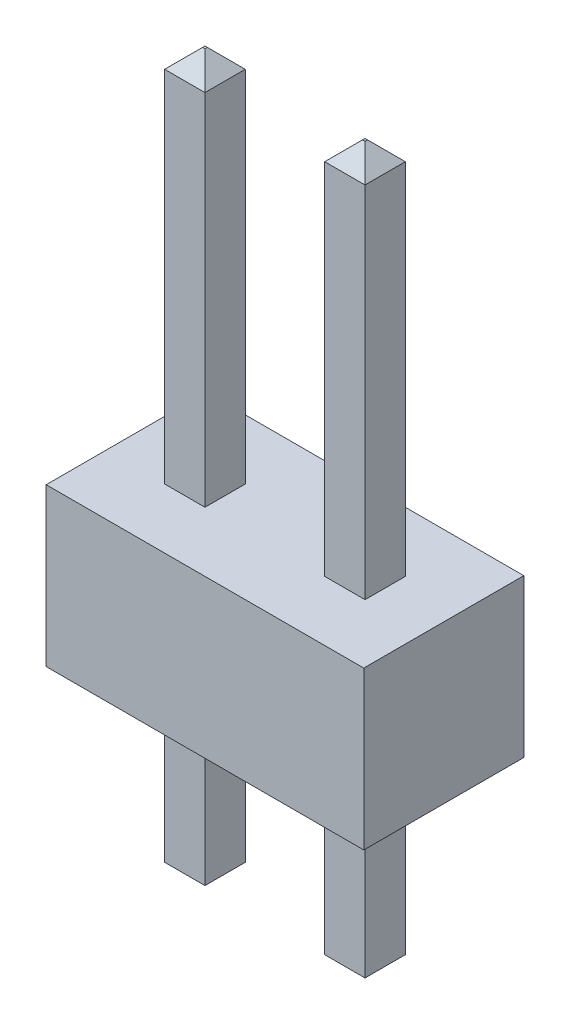
ISO-10303-21;
HEADER;
FILE_DESCRIPTION(('STEP AP214'),'2;1');
FILE_NAME('part.step','',(''),(''),'','','');
FILE_SCHEMA(('AUTOMOTIVE_DESIGN { 1 0 10303 214 1 1 1 1 }'));
ENDSEC;
DATA;
#1=APPLICATION_CONTEXT('core data for automotive mechanical design processes');
#2=APPLICATION_PROTOCOL_DEFINITION('international standard','automotive_design',2000,#1);
#3=PRODUCT_CONTEXT('',#1,'mechanical');
#4=PRODUCT('Part','Part','',(#3));
#5=PRODUCT_RELATED_PRODUCT_CATEGORY('part','',(#4));
#6=PRODUCT_DEFINITION_FORMATION('','',#4);
#7=PRODUCT_DEFINITION_CONTEXT('part definition',#1,'design');
#8=PRODUCT_DEFINITION('design','',#6,#7);
#9=PRODUCT_DEFINITION_SHAPE('','',#8);
#10=(LENGTH_UNIT() NAMED_UNIT(*) SI_UNIT(.MILLI.,.METRE.));
#11=(NAMED_UNIT(*) PLANE_ANGLE_UNIT() SI_UNIT($,.RADIAN.));
#12=(NAMED_UNIT(*) SI_UNIT($,.STERADIAN.) SOLID_ANGLE_UNIT());
#13=UNCERTAINTY_MEASURE_WITH_UNIT(LENGTH_MEASURE(1.E-05),#10,'distance_accuracy_value','');
#14=(GEOMETRIC_REPRESENTATION_CONTEXT(3) GLOBAL_UNCERTAINTY_ASSIGNED_CONTEXT((#13)) GLOBAL_UNIT_ASSIGNED_CONTEXT((#10,
#11,#12)) REPRESENTATION_CONTEXT('',''));
#15=CARTESIAN_POINT('',(0.,0.,0.));
#16=DIRECTION('',(0.,0.,1.));
#17=DIRECTION('',(1.,0.,0.));
#18=AXIS2_PLACEMENT_3D('',#15,#16,#17);
#19=CARTESIAN_POINT('',(1.23,-3.,1.59));
#20=DIRECTION('',(0.707106781186548,0.707106781186548,0.));
#21=DIRECTION('',(-0.707106781186548,0.707106781186548,0.));
#22=AXIS2_PLACEMENT_3D('',#19,#20,#21);
#23=PLANE('',#22);
#24=DIRECTION('',(0.,0.,-1.));
#25=VECTOR('',#24,1.);
#26=CARTESIAN_POINT('',(0.930000000000001,-2.7,0.950000000000001));
#27=LINE('',#26,#25);
#28=CARTESIAN_POINT('',(0.930000000000001,-2.7,1.59));
#29=VERTEX_POINT('',#28);
#30=CARTESIAN_POINT('',(0.930000000000001,-2.7,0.950000000000001));
#31=VERTEX_POINT('',#30);
#32=EDGE_CURVE('E448',#29,#31,#27,.T.);
#33=ORIENTED_EDGE('',*,*,#32,.T.);
#34=DIRECTION('',(0.577350269189625,-0.577350269189625,0.577350269189627));
#35=VECTOR('',#34,1.);
#36=CARTESIAN_POINT('',(0.930000000000001,-2.7,0.95));
#37=LINE('',#36,#35);
#38=CARTESIAN_POINT('',(1.23,-3.,1.25));
#39=VERTEX_POINT('',#38);
#40=EDGE_CURVE('E217',#31,#39,#37,.T.);
#41=ORIENTED_EDGE('',*,*,#40,.T.);
#42=DIRECTION('',(0.,0.,1.));
#43=VECTOR('',#42,1.);
#44=CARTESIAN_POINT('',(1.23,-3.,1.59));
#45=LINE('',#44,#43);
#46=CARTESIAN_POINT('',(1.23,-3.,1.29));
#47=VERTEX_POINT('',#46);
#48=EDGE_CURVE('E459',#39,#47,#45,.T.);
#49=ORIENTED_EDGE('',*,*,#48,.T.);
#50=DIRECTION('',(-0.577350269189625,0.577350269189626,0.577350269189626));
#51=VECTOR('',#50,1.);
#52=CARTESIAN_POINT('',(1.23,-3.,1.29));
#53=LINE('',#52,#51);
#54=EDGE_CURVE('E453',#47,#29,#53,.T.);
#55=ORIENTED_EDGE('',*,*,#54,.T.);
#56=EDGE_LOOP('',(#33,#41,#49,#55));
#57=FACE_BOUND('',#56,.T.);
#58=ADVANCED_FACE('F36',(#57),#23,.F.);
#59=CARTESIAN_POINT('',(3.77,-3.,1.59));
#60=DIRECTION('',(0.707106781186548,0.707106781186548,0.));
#61=DIRECTION('',(-0.707106781186548,0.707106781186548,0.));
#62=AXIS2_PLACEMENT_3D('',#59,#60,#61);
#63=PLANE('',#62);
#64=DIRECTION('',(0.,0.,-1.));
#65=VECTOR('',#64,1.);
#66=CARTESIAN_POINT('',(3.47,-2.7,0.950000000000001));
#67=LINE('',#66,#65);
#68=CARTESIAN_POINT('',(3.47,-2.7,1.59));
#69=VERTEX_POINT('',#68);
#70=CARTESIAN_POINT('',(3.47,-2.7,0.950000000000001));
#71=VERTEX_POINT('',#70);
#72=EDGE_CURVE('E427',#69,#71,#67,.T.);
#73=ORIENTED_EDGE('',*,*,#72,.T.);
#74=DIRECTION('',(0.577350269189626,-0.577350269189625,0.577350269189626));
#75=VECTOR('',#74,1.);
#76=CARTESIAN_POINT('',(3.47,-2.7,0.95));
#77=LINE('',#76,#75);
#78=CARTESIAN_POINT('',(3.77,-3.,1.25));
#79=VERTEX_POINT('',#78);
#80=EDGE_CURVE('E442',#71,#79,#77,.T.);
#81=ORIENTED_EDGE('',*,*,#80,.T.);
#82=DIRECTION('',(0.,0.,1.));
#83=VECTOR('',#82,1.);
#84=CARTESIAN_POINT('',(3.77,-3.,1.59));
#85=LINE('',#84,#83);
#86=CARTESIAN_POINT('',(3.77,-3.,1.29));
#87=VERTEX_POINT('',#86);
#88=EDGE_CURVE('E446',#79,#87,#85,.T.);
#89=ORIENTED_EDGE('',*,*,#88,.T.);
#90=DIRECTION('',(-0.577350269189626,0.577350269189626,0.577350269189626));
#91=VECTOR('',#90,1.);
#92=CARTESIAN_POINT('',(3.77,-3.,1.29));
#93=LINE('',#92,#91);
#94=EDGE_CURVE('E433',#87,#69,#93,.T.);
#95=ORIENTED_EDGE('',*,*,#94,.T.);
#96=EDGE_LOOP('',(#73,#81,#89,#95));
#97=FACE_BOUND('',#96,.T.);
#98=ADVANCED_FACE('F488',(#97),#63,.F.);
#99=CARTESIAN_POINT('',(1.57,-3.,1.25));
#100=DIRECTION('',(0.,0.707106781186548,0.707106781186547));
#101=DIRECTION('',(0.,-0.707106781186547,0.707106781186548));
#102=AXIS2_PLACEMENT_3D('',#99,#100,#101);
#103=PLANE('',#102);
#104=DIRECTION('',(1.,0.,0.));
#105=VECTOR('',#104,1.);
#106=CARTESIAN_POINT('',(0.930000000000001,-2.7,0.950000000000001));
#107=LINE('',#106,#105);
#108=CARTESIAN_POINT('',(1.57,-2.7,0.950000000000001));
#109=VERTEX_POINT('',#108);
#110=EDGE_CURVE('E415',#31,#109,#107,.T.);
#111=ORIENTED_EDGE('',*,*,#110,.T.);
#112=DIRECTION('',(-0.577350269189626,-0.577350269189626,0.577350269189625));
#113=VECTOR('',#112,1.);
#114=CARTESIAN_POINT('',(1.57,-2.7,0.950000000000001));
#115=LINE('',#114,#113);
#116=CARTESIAN_POINT('',(1.27,-3.,1.25));
#117=VERTEX_POINT('',#116);
#118=EDGE_CURVE('E412',#109,#117,#115,.T.);
#119=ORIENTED_EDGE('',*,*,#118,.T.);
#120=DIRECTION('',(1.,0.,0.));
#121=VECTOR('',#120,1.);
#122=CARTESIAN_POINT('',(1.57,-3.,1.25));
#123=LINE('',#122,#121);
#124=EDGE_CURVE('E461',#117,#39,#123,.F.);
#125=ORIENTED_EDGE('',*,*,#124,.T.);
#126=ORIENTED_EDGE('',*,*,#40,.F.);
#127=EDGE_LOOP('',(#111,#119,#125,#126));
#128=FACE_BOUND('',#127,.T.);
#129=ADVANCED_FACE('F464',(#128),#103,.F.);
#130=CARTESIAN_POINT('',(1.57,-3.,1.59));
#131=DIRECTION('',(0.,1.,0.));
#132=DIRECTION('',(0.,0.,1.));
#133=AXIS2_PLACEMENT_3D('',#130,#131,#132);
#134=PLANE('',#133);
#135=ORIENTED_EDGE('',*,*,#124,.F.);
#136=DIRECTION('',(0.,0.,1.));
#137=VECTOR('',#136,1.);
#138=CARTESIAN_POINT('',(1.27,-3.,1.59));
#139=LINE('',#138,#137);
#140=CARTESIAN_POINT('',(1.27,-3.,1.29));
#141=VERTEX_POINT('',#140);
#142=EDGE_CURVE('E409',#117,#141,#139,.T.);
#143=ORIENTED_EDGE('',*,*,#142,.T.);
#144=DIRECTION('',(1.,0.,0.));
#145=VECTOR('',#144,1.);
#146=CARTESIAN_POINT('',(1.57,-3.,1.29));
#147=LINE('',#146,#145);
#148=EDGE_CURVE('E456',#141,#47,#147,.F.);
#149=ORIENTED_EDGE('',*,*,#148,.T.);
#150=ORIENTED_EDGE('',*,*,#48,.F.);
#151=EDGE_LOOP('',(#135,#143,#149,#150));
#152=FACE_BOUND('',#151,.T.);
#153=ADVANCED_FACE('F467',(#152),#134,.F.);
#154=CARTESIAN_POINT('',(1.57,-3.,1.29));
#155=DIRECTION('',(0.,0.707106781186548,-0.707106781186548));
#156=DIRECTION('',(0.,0.707106781186548,0.707106781186548));
#157=AXIS2_PLACEMENT_3D('',#154,#155,#156);
#158=PLANE('',#157);
#159=DIRECTION('',(-1.,0.,0.));
#160=VECTOR('',#159,1.);
#161=CARTESIAN_POINT('',(0.930000000000001,-2.7,1.59));
#162=LINE('',#161,#160);
#163=CARTESIAN_POINT('',(1.57,-2.7,1.59));
#164=VERTEX_POINT('',#163);
#165=EDGE_CURVE('E401',#164,#29,#162,.T.);
#166=ORIENTED_EDGE('',*,*,#165,.T.);
#167=ORIENTED_EDGE('',*,*,#54,.F.);
#168=ORIENTED_EDGE('',*,*,#148,.F.);
#169=DIRECTION('',(0.577350269189626,0.577350269189626,0.577350269189626));
#170=VECTOR('',#169,1.);
#171=CARTESIAN_POINT('',(1.27,-3.,1.29));
#172=LINE('',#171,#170);
#173=EDGE_CURVE('E406',#141,#164,#172,.T.);
#174=ORIENTED_EDGE('',*,*,#173,.T.);
#175=EDGE_LOOP('',(#166,#167,#168,#174));
#176=FACE_BOUND('',#175,.T.);
#177=ADVANCED_FACE('F474',(#176),#158,.F.);
#178=CARTESIAN_POINT('',(0.930000000000001,-3.,0.950000000000001));
#179=DIRECTION('',(1.,0.,0.));
#180=DIRECTION('',(0.,0.,-1.));
#181=AXIS2_PLACEMENT_3D('',#178,#179,#180);
#182=PLANE('',#181);
#183=ORIENTED_EDGE('',*,*,#32,.F.);
#184=DIRECTION('',(0.,1.,0.));
#185=VECTOR('',#184,1.);
#186=CARTESIAN_POINT('',(0.930000000000001,-3.,1.59));
#187=LINE('',#186,#185);
#188=CARTESIAN_POINT('',(0.930000000000001,0.,1.59));
#189=VERTEX_POINT('',#188);
#190=EDGE_CURVE('E398',#29,#189,#187,.T.);
#191=ORIENTED_EDGE('',*,*,#190,.T.);
#192=DIRECTION('',(0.,0.,-1.));
#193=VECTOR('',#192,1.);
#194=CARTESIAN_POINT('',(0.930000000000001,0.,0.950000000000001));
#195=LINE('',#194,#193);
#196=CARTESIAN_POINT('',(0.930000000000001,0.,0.950000000000001));
#197=VERTEX_POINT('',#196);
#198=EDGE_CURVE('E450',#197,#189,#195,.F.);
#199=ORIENTED_EDGE('',*,*,#198,.F.);
#200=DIRECTION('',(0.,1.,0.));
#201=VECTOR('',#200,1.);
#202=CARTESIAN_POINT('',(0.930000000000001,-3.,0.950000000000001));
#203=LINE('',#202,#201);
#204=EDGE_CURVE('E419',#197,#31,#203,.F.);
#205=ORIENTED_EDGE('',*,*,#204,.T.);
#206=EDGE_LOOP('',(#183,#191,#199,#205));
#207=FACE_BOUND('',#206,.T.);
#208=ADVANCED_FACE('F484',(#207),#182,.F.);
#209=CARTESIAN_POINT('',(4.11,-3.,1.59));
#210=DIRECTION('',(0.,1.,0.));
#211=DIRECTION('',(0.,0.,1.));
#212=AXIS2_PLACEMENT_3D('',#209,#210,#211);
#213=PLANE('',#212);
#214=ORIENTED_EDGE('',*,*,#88,.F.);
#215=DIRECTION('',(1.,0.,0.));
#216=VECTOR('',#215,1.);
#217=CARTESIAN_POINT('',(4.11,-3.,1.25));
#218=LINE('',#217,#216);
#219=CARTESIAN_POINT('',(3.81,-3.,1.25));
#220=VERTEX_POINT('',#219);
#221=EDGE_CURVE('E439',#79,#220,#218,.T.);
#222=ORIENTED_EDGE('',*,*,#221,.T.);
#223=DIRECTION('',(0.,0.,1.));
#224=VECTOR('',#223,1.);
#225=CARTESIAN_POINT('',(3.81,-3.,1.59));
#226=LINE('',#225,#224);
#227=CARTESIAN_POINT('',(3.81,-3.,1.29));
#228=VERTEX_POINT('',#227);
#229=EDGE_CURVE('E384',#220,#228,#226,.T.);
#230=ORIENTED_EDGE('',*,*,#229,.T.);
#231=DIRECTION('',(1.,0.,0.));
#232=VECTOR('',#231,1.);
#233=CARTESIAN_POINT('',(4.11,-3.,1.29));
#234=LINE('',#233,#232);
#235=EDGE_CURVE('E436',#228,#87,#234,.F.);
#236=ORIENTED_EDGE('',*,*,#235,.T.);
#237=EDGE_LOOP('',(#214,#222,#230,#236));
#238=FACE_BOUND('',#237,.T.);
#239=ADVANCED_FACE('F624',(#238),#213,.F.);
#240=CARTESIAN_POINT('',(4.11,-3.,1.25));
#241=DIRECTION('',(0.,0.707106781186548,0.707106781186547));
#242=DIRECTION('',(0.,-0.707106781186547,0.707106781186548));
#243=AXIS2_PLACEMENT_3D('',#240,#241,#242);
#244=PLANE('',#243);
#245=ORIENTED_EDGE('',*,*,#221,.F.);
#246=ORIENTED_EDGE('',*,*,#80,.F.);
#247=DIRECTION('',(1.,0.,0.));
#248=VECTOR('',#247,1.);
#249=CARTESIAN_POINT('',(3.47,-2.7,0.950000000000001));
#250=LINE('',#249,#248);
#251=CARTESIAN_POINT('',(4.11,-2.7,0.950000000000001));
#252=VERTEX_POINT('',#251);
#253=EDGE_CURVE('E387',#71,#252,#250,.T.);
#254=ORIENTED_EDGE('',*,*,#253,.T.);
#255=DIRECTION('',(-0.577350269189627,-0.577350269189627,0.577350269189624));
#256=VECTOR('',#255,1.);
#257=CARTESIAN_POINT('',(4.11,-2.7,0.950000000000001));
#258=LINE('',#257,#256);
#259=EDGE_CURVE('E378',#252,#220,#258,.T.);
#260=ORIENTED_EDGE('',*,*,#259,.T.);
#261=EDGE_LOOP('',(#245,#246,#254,#260));
#262=FACE_BOUND('',#261,.T.);
#263=ADVANCED_FACE('F620',(#262),#244,.F.);
#264=CARTESIAN_POINT('',(4.11,-3.,1.29));
#265=DIRECTION('',(0.,0.707106781186548,-0.707106781186548));
#266=DIRECTION('',(0.,0.707106781186548,0.707106781186548));
#267=AXIS2_PLACEMENT_3D('',#264,#265,#266);
#268=PLANE('',#267);
#269=DIRECTION('',(-1.,0.,0.));
#270=VECTOR('',#269,1.);
#271=CARTESIAN_POINT('',(3.47,-2.7,1.59));
#272=LINE('',#271,#270);
#273=CARTESIAN_POINT('',(4.11,-2.7,1.59));
#274=VERTEX_POINT('',#273);
#275=EDGE_CURVE('E372',#274,#69,#272,.T.);
#276=ORIENTED_EDGE('',*,*,#275,.T.);
#277=ORIENTED_EDGE('',*,*,#94,.F.);
#278=ORIENTED_EDGE('',*,*,#235,.F.);
#279=DIRECTION('',(0.577350269189626,0.577350269189626,0.577350269189625));
#280=VECTOR('',#279,1.);
#281=CARTESIAN_POINT('',(3.81,-3.,1.29));
#282=LINE('',#281,#280);
#283=EDGE_CURVE('E381',#228,#274,#282,.T.);
#284=ORIENTED_EDGE('',*,*,#283,.T.);
#285=EDGE_LOOP('',(#276,#277,#278,#284));
#286=FACE_BOUND('',#285,.T.);
#287=ADVANCED_FACE('F616',(#286),#268,.F.);
#288=CARTESIAN_POINT('',(3.47,-3.,0.950000000000001));
#289=DIRECTION('',(1.,0.,0.));
#290=DIRECTION('',(0.,0.,-1.));
#291=AXIS2_PLACEMENT_3D('',#288,#289,#290);
#292=PLANE('',#291);
#293=ORIENTED_EDGE('',*,*,#72,.F.);
#294=DIRECTION('',(0.,1.,0.));
#295=VECTOR('',#294,1.);
#296=CARTESIAN_POINT('',(3.47,-3.,1.59));
#297=LINE('',#296,#295);
#298=CARTESIAN_POINT('',(3.47,0.,1.59));
#299=VERTEX_POINT('',#298);
#300=EDGE_CURVE('E368',#69,#299,#297,.T.);
#301=ORIENTED_EDGE('',*,*,#300,.T.);
#302=DIRECTION('',(0.,0.,-1.));
#303=VECTOR('',#302,1.);
#304=CARTESIAN_POINT('',(3.47,0.,0.950000000000001));
#305=LINE('',#304,#303);
#306=CARTESIAN_POINT('',(3.47,0.,0.950000000000001));
#307=VERTEX_POINT('',#306);
#308=EDGE_CURVE('E430',#307,#299,#305,.F.);
#309=ORIENTED_EDGE('',*,*,#308,.F.);
#310=DIRECTION('',(0.,1.,0.));
#311=VECTOR('',#310,1.);
#312=CARTESIAN_POINT('',(3.47,-3.,0.950000000000001));
#313=LINE('',#312,#311);
#314=EDGE_CURVE('E391',#307,#71,#313,.F.);
#315=ORIENTED_EDGE('',*,*,#314,.T.);
#316=EDGE_LOOP('',(#293,#301,#309,#315));
#317=FACE_BOUND('',#316,.T.);
#318=ADVANCED_FACE('F612',(#317),#292,.F.);
#319=CARTESIAN_POINT('',(0.930000000000001,-3.,0.950000000000001));
#320=DIRECTION('',(0.,0.,1.));
#321=DIRECTION('',(1.,0.,0.));
#322=AXIS2_PLACEMENT_3D('',#319,#320,#321);
#323=PLANE('',#322);
#324=ORIENTED_EDGE('',*,*,#110,.F.);
#325=ORIENTED_EDGE('',*,*,#204,.F.);
#326=DIRECTION('',(1.,0.,0.));
#327=VECTOR('',#326,1.);
#328=CARTESIAN_POINT('',(0.930000000000001,0.,0.950000000000001));
#329=LINE('',#328,#327);
#330=CARTESIAN_POINT('',(1.57,0.,0.950000000000001));
#331=VERTEX_POINT('',#330);
#332=EDGE_CURVE('E423',#331,#197,#329,.F.);
#333=ORIENTED_EDGE('',*,*,#332,.F.);
#334=DIRECTION('',(0.,1.,0.));
#335=VECTOR('',#334,1.);
#336=CARTESIAN_POINT('',(1.57,-3.,0.950000000000001));
#337=LINE('',#336,#335);
#338=EDGE_CURVE('E364',#331,#109,#337,.F.);
#339=ORIENTED_EDGE('',*,*,#338,.T.);
#340=EDGE_LOOP('',(#324,#325,#333,#339));
#341=FACE_BOUND('',#340,.T.);
#342=ADVANCED_FACE('F609',(#341),#323,.F.);
#343=CARTESIAN_POINT('',(1.27,-3.,1.59));
#344=DIRECTION('',(-0.707106781186548,0.707106781186548,0.));
#345=DIRECTION('',(-0.707106781186548,-0.707106781186548,0.));
#346=AXIS2_PLACEMENT_3D('',#343,#344,#345);
#347=PLANE('',#346);
#348=ORIENTED_EDGE('',*,*,#142,.F.);
#349=ORIENTED_EDGE('',*,*,#118,.F.);
#350=DIRECTION('',(0.,0.,1.));
#351=VECTOR('',#350,1.);
#352=CARTESIAN_POINT('',(1.57,-2.7,0.950000000000001));
#353=LINE('',#352,#351);
#354=EDGE_CURVE('E361',#109,#164,#353,.T.);
#355=ORIENTED_EDGE('',*,*,#354,.T.);
#356=ORIENTED_EDGE('',*,*,#173,.F.);
#357=EDGE_LOOP('',(#348,#349,#355,#356));
#358=FACE_BOUND('',#357,.T.);
#359=ADVANCED_FACE('F470',(#358),#347,.F.);
#360=CARTESIAN_POINT('',(0.930000000000001,-3.,1.59));
#361=DIRECTION('',(0.,0.,-1.));
#362=DIRECTION('',(-1.,0.,0.));
#363=AXIS2_PLACEMENT_3D('',#360,#361,#362);
#364=PLANE('',#363);
#365=ORIENTED_EDGE('',*,*,#165,.F.);
#366=DIRECTION('',(0.,1.,0.));
#367=VECTOR('',#366,1.);
#368=CARTESIAN_POINT('',(1.57,-3.,1.59));
#369=LINE('',#368,#367);
#370=CARTESIAN_POINT('',(1.57,0.,1.59));
#371=VERTEX_POINT('',#370);
#372=EDGE_CURVE('E358',#164,#371,#369,.T.);
#373=ORIENTED_EDGE('',*,*,#372,.T.);
#374=DIRECTION('',(-1.,0.,0.));
#375=VECTOR('',#374,1.);
#376=CARTESIAN_POINT('',(0.930000000000001,0.,1.59));
#377=LINE('',#376,#375);
#378=EDGE_CURVE('E404',#189,#371,#377,.F.);
#379=ORIENTED_EDGE('',*,*,#378,.F.);
#380=ORIENTED_EDGE('',*,*,#190,.F.);
#381=EDGE_LOOP('',(#365,#373,#379,#380));
#382=FACE_BOUND('',#381,.T.);
#383=ADVANCED_FACE('F481',(#382),#364,.F.);
#384=CARTESIAN_POINT('',(3.47,-3.,0.950000000000001));
#385=DIRECTION('',(0.,0.,1.));
#386=DIRECTION('',(1.,0.,0.));
#387=AXIS2_PLACEMENT_3D('',#384,#385,#386);
#388=PLANE('',#387);
#389=ORIENTED_EDGE('',*,*,#253,.F.);
#390=ORIENTED_EDGE('',*,*,#314,.F.);
#391=DIRECTION('',(1.,0.,0.));
#392=VECTOR('',#391,1.);
#393=CARTESIAN_POINT('',(3.47,0.,0.950000000000001));
#394=LINE('',#393,#392);
#395=CARTESIAN_POINT('',(4.11,0.,0.950000000000001));
#396=VERTEX_POINT('',#395);
#397=EDGE_CURVE('E395',#396,#307,#394,.F.);
#398=ORIENTED_EDGE('',*,*,#397,.F.);
#399=DIRECTION('',(0.,1.,0.));
#400=VECTOR('',#399,1.);
#401=CARTESIAN_POINT('',(4.11,-3.,0.950000000000001));
#402=LINE('',#401,#400);
#403=EDGE_CURVE('E354',#396,#252,#402,.F.);
#404=ORIENTED_EDGE('',*,*,#403,.T.);
#405=EDGE_LOOP('',(#389,#390,#398,#404));
#406=FACE_BOUND('',#405,.T.);
#407=ADVANCED_FACE('F600',(#406),#388,.F.);
#408=CARTESIAN_POINT('',(3.81,-3.,1.59));
#409=DIRECTION('',(-0.707106781186548,0.707106781186548,0.));
#410=DIRECTION('',(-0.707106781186548,-0.707106781186548,0.));
#411=AXIS2_PLACEMENT_3D('',#408,#409,#410);
#412=PLANE('',#411);
#413=DIRECTION('',(0.,0.,1.));
#414=VECTOR('',#413,1.);
#415=CARTESIAN_POINT('',(4.11,-2.7,0.950000000000001));
#416=LINE('',#415,#414);
#417=EDGE_CURVE('E350',#252,#274,#416,.T.);
#418=ORIENTED_EDGE('',*,*,#417,.T.);
#419=ORIENTED_EDGE('',*,*,#283,.F.);
#420=ORIENTED_EDGE('',*,*,#229,.F.);
#421=ORIENTED_EDGE('',*,*,#259,.F.);
#422=EDGE_LOOP('',(#418,#419,#420,#421));
#423=FACE_BOUND('',#422,.T.);
#424=ADVANCED_FACE('F596',(#423),#412,.F.);
#425=CARTESIAN_POINT('',(3.47,-3.,1.59));
#426=DIRECTION('',(0.,0.,-1.));
#427=DIRECTION('',(-1.,0.,0.));
#428=AXIS2_PLACEMENT_3D('',#425,#426,#427);
#429=PLANE('',#428);
#430=ORIENTED_EDGE('',*,*,#275,.F.);
#431=DIRECTION('',(0.,1.,0.));
#432=VECTOR('',#431,1.);
#433=CARTESIAN_POINT('',(4.11,-3.,1.59));
#434=LINE('',#433,#432);
#435=CARTESIAN_POINT('',(4.11,0.,1.59));
#436=VERTEX_POINT('',#435);
#437=EDGE_CURVE('E346',#274,#436,#434,.T.);
#438=ORIENTED_EDGE('',*,*,#437,.T.);
#439=DIRECTION('',(-1.,0.,0.));
#440=VECTOR('',#439,1.);
#441=CARTESIAN_POINT('',(3.47,0.,1.59));
#442=LINE('',#441,#440);
#443=EDGE_CURVE('E376',#299,#436,#442,.F.);
#444=ORIENTED_EDGE('',*,*,#443,.F.);
#445=ORIENTED_EDGE('',*,*,#300,.F.);
#446=EDGE_LOOP('',(#430,#438,#444,#445));
#447=FACE_BOUND('',#446,.T.);
#448=ADVANCED_FACE('F592',(#447),#429,.F.);
#449=CARTESIAN_POINT('',(1.23,8.5,1.59));
#450=DIRECTION('',(-0.707106781186549,0.707106781186546,0.));
#451=DIRECTION('',(-0.707106781186546,-0.707106781186549,0.));
#452=AXIS2_PLACEMENT_3D('',#449,#450,#451);
#453=PLANE('',#452);
#454=DIRECTION('',(-0.577350269189627,-0.577350269189627,0.577350269189624));
#455=VECTOR('',#454,1.);
#456=CARTESIAN_POINT('',(1.23,8.5,1.29));
#457=LINE('',#456,#455);
#458=CARTESIAN_POINT('',(1.23,8.5,1.29));
#459=VERTEX_POINT('',#458);
#460=CARTESIAN_POINT('',(0.929999999999999,8.2,1.59));
#461=VERTEX_POINT('',#460);
#462=EDGE_CURVE('E344',#459,#461,#457,.T.);
#463=ORIENTED_EDGE('',*,*,#462,.F.);
#464=DIRECTION('',(0.,0.,1.));
#465=VECTOR('',#464,1.);
#466=CARTESIAN_POINT('',(1.23,8.5,1.59));
#467=LINE('',#466,#465);
#468=CARTESIAN_POINT('',(1.23,8.5,1.25));
#469=VERTEX_POINT('',#468);
#470=EDGE_CURVE('E339',#469,#459,#467,.T.);
#471=ORIENTED_EDGE('',*,*,#470,.F.);
#472=DIRECTION('',(0.577350269189627,0.577350269189627,0.577350269189624));
#473=VECTOR('',#472,1.);
#474=CARTESIAN_POINT('',(0.929999999999998,8.2,0.95));
#475=LINE('',#474,#473);
#476=CARTESIAN_POINT('',(0.929999999999999,8.2,0.95));
#477=VERTEX_POINT('',#476);
#478=EDGE_CURVE('E337',#477,#469,#475,.T.);
#479=ORIENTED_EDGE('',*,*,#478,.F.);
#480=DIRECTION('',(0.,0.,-1.));
#481=VECTOR('',#480,1.);
#482=CARTESIAN_POINT('',(0.929999999999998,8.2,0.95));
#483=LINE('',#482,#481);
#484=EDGE_CURVE('E328',#477,#461,#483,.F.);
#485=ORIENTED_EDGE('',*,*,#484,.T.);
#486=EDGE_LOOP('',(#463,#471,#479,#485));
#487=FACE_BOUND('',#486,.T.);
#488=ADVANCED_FACE('F588',(#487),#453,.T.);
#489=CARTESIAN_POINT('',(3.77,8.5,1.59));
#490=DIRECTION('',(-0.70710678118655,0.707106781186545,0.));
#491=DIRECTION('',(-0.707106781186545,-0.70710678118655,0.));
#492=AXIS2_PLACEMENT_3D('',#489,#490,#491);
#493=PLANE('',#492);
#494=DIRECTION('',(-0.577350269189624,-0.577350269189628,0.577350269189625));
#495=VECTOR('',#494,1.);
#496=CARTESIAN_POINT('',(3.77,8.5,1.29));
#497=LINE('',#496,#495);
#498=CARTESIAN_POINT('',(3.77,8.5,1.29));
#499=VERTEX_POINT('',#498);
#500=CARTESIAN_POINT('',(3.47,8.2,1.59));
#501=VERTEX_POINT('',#500);
#502=EDGE_CURVE('E324',#499,#501,#497,.T.);
#503=ORIENTED_EDGE('',*,*,#502,.F.);
#504=DIRECTION('',(0.,0.,1.));
#505=VECTOR('',#504,1.);
#506=CARTESIAN_POINT('',(3.77,8.5,1.59));
#507=LINE('',#506,#505);
#508=CARTESIAN_POINT('',(3.77,8.5,1.25));
#509=VERTEX_POINT('',#508);
#510=EDGE_CURVE('E326',#509,#499,#507,.T.);
#511=ORIENTED_EDGE('',*,*,#510,.F.);
#512=DIRECTION('',(0.577350269189624,0.577350269189629,0.577350269189624));
#513=VECTOR('',#512,1.);
#514=CARTESIAN_POINT('',(3.47,8.2,0.950000000000001));
#515=LINE('',#514,#513);
#516=CARTESIAN_POINT('',(3.47,8.2,0.95));
#517=VERTEX_POINT('',#516);
#518=EDGE_CURVE('E319',#517,#509,#515,.T.);
#519=ORIENTED_EDGE('',*,*,#518,.F.);
#520=DIRECTION('',(0.,0.,-1.));
#521=VECTOR('',#520,1.);
#522=CARTESIAN_POINT('',(3.47,8.2,0.95));
#523=LINE('',#522,#521);
#524=EDGE_CURVE('E311',#517,#501,#523,.F.);
#525=ORIENTED_EDGE('',*,*,#524,.T.);
#526=EDGE_LOOP('',(#503,#511,#519,#525));
#527=FACE_BOUND('',#526,.T.);
#528=ADVANCED_FACE('F585',(#527),#493,.T.);
#529=CARTESIAN_POINT('',(1.57,-3.,0.950000000000001));
#530=DIRECTION('',(-1.,0.,0.));
#531=DIRECTION('',(0.,0.,1.));
#532=AXIS2_PLACEMENT_3D('',#529,#530,#531);
#533=PLANE('',#532);
#534=ORIENTED_EDGE('',*,*,#354,.F.);
#535=ORIENTED_EDGE('',*,*,#338,.F.);
#536=DIRECTION('',(0.,0.,1.));
#537=VECTOR('',#536,1.);
#538=CARTESIAN_POINT('',(1.57,0.,7.62));
#539=LINE('',#538,#537);
#540=EDGE_CURVE('E307',#331,#371,#539,.T.);
#541=ORIENTED_EDGE('',*,*,#540,.T.);
#542=ORIENTED_EDGE('',*,*,#372,.F.);
#543=EDGE_LOOP('',(#534,#535,#541,#542));
#544=FACE_BOUND('',#543,.T.);
#545=ADVANCED_FACE('F477',(#544),#533,.F.);
#546=CARTESIAN_POINT('',(4.11,-3.,0.950000000000001));
#547=DIRECTION('',(-1.,0.,0.));
#548=DIRECTION('',(0.,0.,1.));
#549=AXIS2_PLACEMENT_3D('',#546,#547,#548);
#550=PLANE('',#549);
#551=ORIENTED_EDGE('',*,*,#417,.F.);
#552=ORIENTED_EDGE('',*,*,#403,.F.);
#553=DIRECTION('',(0.,0.,1.));
#554=VECTOR('',#553,1.);
#555=CARTESIAN_POINT('',(4.11,0.,7.62));
#556=LINE('',#555,#554);
#557=EDGE_CURVE('E304',#396,#436,#556,.T.);
#558=ORIENTED_EDGE('',*,*,#557,.T.);
#559=ORIENTED_EDGE('',*,*,#437,.F.);
#560=EDGE_LOOP('',(#551,#552,#558,#559));
#561=FACE_BOUND('',#560,.T.);
#562=ADVANCED_FACE('F578',(#561),#550,.F.);
#563=CARTESIAN_POINT('',(1.57,8.5,1.29));
#564=DIRECTION('',(0.,0.707106781186545,0.70710678118655));
#565=DIRECTION('',(0.,-0.70710678118655,0.707106781186545));
#566=AXIS2_PLACEMENT_3D('',#563,#564,#565);
#567=PLANE('',#566);
#568=DIRECTION('',(0.577350269189625,-0.577350269189628,0.577350269189625));
#569=VECTOR('',#568,1.);
#570=CARTESIAN_POINT('',(1.27,8.5,1.29));
#571=LINE('',#570,#569);
#572=CARTESIAN_POINT('',(1.27,8.5,1.29));
#573=VERTEX_POINT('',#572);
#574=CARTESIAN_POINT('',(1.57,8.2,1.59));
#575=VERTEX_POINT('',#574);
#576=EDGE_CURVE('E291',#573,#575,#571,.T.);
#577=ORIENTED_EDGE('',*,*,#576,.F.);
#578=DIRECTION('',(1.,0.,0.));
#579=VECTOR('',#578,1.);
#580=CARTESIAN_POINT('',(1.57,8.5,1.29));
#581=LINE('',#580,#579);
#582=EDGE_CURVE('E342',#459,#573,#581,.T.);
#583=ORIENTED_EDGE('',*,*,#582,.F.);
#584=ORIENTED_EDGE('',*,*,#462,.T.);
#585=DIRECTION('',(-1.,0.,0.));
#586=VECTOR('',#585,1.);
#587=CARTESIAN_POINT('',(0.929999999999998,8.2,1.59));
#588=LINE('',#587,#586);
#589=EDGE_CURVE('E293',#461,#575,#588,.F.);
#590=ORIENTED_EDGE('',*,*,#589,.T.);
#591=EDGE_LOOP('',(#577,#583,#584,#590));
#592=FACE_BOUND('',#591,.T.);
#593=ADVANCED_FACE('F574',(#592),#567,.T.);
#594=CARTESIAN_POINT('',(1.57,8.5,1.59));
#595=DIRECTION('',(0.,1.,0.));
#596=DIRECTION('',(0.,0.,1.));
#597=AXIS2_PLACEMENT_3D('',#594,#595,#596);
#598=PLANE('',#597);
#599=DIRECTION('',(1.,0.,0.));
#600=VECTOR('',#599,1.);
#601=CARTESIAN_POINT('',(1.57,8.5,1.25));
#602=LINE('',#601,#600);
#603=CARTESIAN_POINT('',(1.27,8.5,1.25));
#604=VERTEX_POINT('',#603);
#605=EDGE_CURVE('E335',#469,#604,#602,.T.);
#606=ORIENTED_EDGE('',*,*,#605,.F.);
#607=ORIENTED_EDGE('',*,*,#470,.T.);
#608=ORIENTED_EDGE('',*,*,#582,.T.);
#609=DIRECTION('',(0.,0.,1.));
#610=VECTOR('',#609,1.);
#611=CARTESIAN_POINT('',(1.27,8.5,1.59));
#612=LINE('',#611,#610);
#613=EDGE_CURVE('E285',#604,#573,#612,.T.);
#614=ORIENTED_EDGE('',*,*,#613,.F.);
#615=EDGE_LOOP('',(#606,#607,#608,#614));
#616=FACE_BOUND('',#615,.T.);
#617=ADVANCED_FACE('F570',(#616),#598,.T.);
#618=CARTESIAN_POINT('',(1.57,8.5,1.25));
#619=DIRECTION('',(0.,0.707106781186546,-0.707106781186549));
#620=DIRECTION('',(0.,0.707106781186549,0.707106781186546));
#621=AXIS2_PLACEMENT_3D('',#618,#619,#620);
#622=PLANE('',#621);
#623=DIRECTION('',(-0.577350269189625,0.577350269189628,0.577350269189625));
#624=VECTOR('',#623,1.);
#625=CARTESIAN_POINT('',(1.57,8.2,0.95));
#626=LINE('',#625,#624);
#627=CARTESIAN_POINT('',(1.57,8.2,0.95));
#628=VERTEX_POINT('',#627);
#629=EDGE_CURVE('E288',#628,#604,#626,.T.);
#630=ORIENTED_EDGE('',*,*,#629,.F.);
#631=DIRECTION('',(1.,0.,0.));
#632=VECTOR('',#631,1.);
#633=CARTESIAN_POINT('',(0.929999999999998,8.2,0.95));
#634=LINE('',#633,#632);
#635=EDGE_CURVE('E280',#628,#477,#634,.F.);
#636=ORIENTED_EDGE('',*,*,#635,.T.);
#637=ORIENTED_EDGE('',*,*,#478,.T.);
#638=ORIENTED_EDGE('',*,*,#605,.T.);
#639=EDGE_LOOP('',(#630,#636,#637,#638));
#640=FACE_BOUND('',#639,.T.);
#641=ADVANCED_FACE('F566',(#640),#622,.T.);
#642=CARTESIAN_POINT('',(0.929999999999998,8.5,0.95));
#643=DIRECTION('',(1.,0.,0.));
#644=DIRECTION('',(0.,0.,-1.));
#645=AXIS2_PLACEMENT_3D('',#642,#643,#644);
#646=PLANE('',#645);
#647=ORIENTED_EDGE('',*,*,#484,.F.);
#648=DIRECTION('',(0.,1.,0.));
#649=VECTOR('',#648,1.);
#650=CARTESIAN_POINT('',(0.929999999999998,8.5,0.95));
#651=LINE('',#650,#649);
#652=CARTESIAN_POINT('',(0.929999999999998,2.5,0.95));
#653=VERTEX_POINT('',#652);
#654=EDGE_CURVE('E277',#477,#653,#651,.F.);
#655=ORIENTED_EDGE('',*,*,#654,.T.);
#656=DIRECTION('',(0.,0.,-1.));
#657=VECTOR('',#656,1.);
#658=CARTESIAN_POINT('',(0.929999999999998,2.5,0.95));
#659=LINE('',#658,#657);
#660=CARTESIAN_POINT('',(0.929999999999998,2.5,1.59));
#661=VERTEX_POINT('',#660);
#662=EDGE_CURVE('E331',#661,#653,#659,.T.);
#663=ORIENTED_EDGE('',*,*,#662,.F.);
#664=DIRECTION('',(0.,1.,0.));
#665=VECTOR('',#664,1.);
#666=CARTESIAN_POINT('',(0.929999999999998,8.5,1.59));
#667=LINE('',#666,#665);
#668=EDGE_CURVE('E296',#661,#461,#667,.T.);
#669=ORIENTED_EDGE('',*,*,#668,.T.);
#670=EDGE_LOOP('',(#647,#655,#663,#669));
#671=FACE_BOUND('',#670,.T.);
#672=ADVANCED_FACE('F562',(#671),#646,.F.);
#673=CARTESIAN_POINT('',(4.11,8.5,1.59));
#674=DIRECTION('',(0.,1.,0.));
#675=DIRECTION('',(0.,0.,1.));
#676=AXIS2_PLACEMENT_3D('',#673,#674,#675);
#677=PLANE('',#676);
#678=DIRECTION('',(0.,0.,1.));
#679=VECTOR('',#678,1.);
#680=CARTESIAN_POINT('',(3.81,8.5,1.59));
#681=LINE('',#680,#679);
#682=CARTESIAN_POINT('',(3.81,8.5,1.25));
#683=VERTEX_POINT('',#682);
#684=CARTESIAN_POINT('',(3.81,8.5,1.29));
#685=VERTEX_POINT('',#684);
#686=EDGE_CURVE('E264',#683,#685,#681,.T.);
#687=ORIENTED_EDGE('',*,*,#686,.F.);
#688=DIRECTION('',(1.,0.,0.));
#689=VECTOR('',#688,1.);
#690=CARTESIAN_POINT('',(4.11,8.5,1.25));
#691=LINE('',#690,#689);
#692=EDGE_CURVE('E317',#509,#683,#691,.T.);
#693=ORIENTED_EDGE('',*,*,#692,.F.);
#694=ORIENTED_EDGE('',*,*,#510,.T.);
#695=DIRECTION('',(1.,0.,0.));
#696=VECTOR('',#695,1.);
#697=CARTESIAN_POINT('',(4.11,8.5,1.29));
#698=LINE('',#697,#696);
#699=EDGE_CURVE('E321',#685,#499,#698,.F.);
#700=ORIENTED_EDGE('',*,*,#699,.F.);
#701=EDGE_LOOP('',(#687,#693,#694,#700));
#702=FACE_BOUND('',#701,.T.);
#703=ADVANCED_FACE('F558',(#702),#677,.T.);
#704=CARTESIAN_POINT('',(4.11,8.5,1.29));
#705=DIRECTION('',(0.,0.707106781186545,0.70710678118655));
#706=DIRECTION('',(0.,-0.70710678118655,0.707106781186545));
#707=AXIS2_PLACEMENT_3D('',#704,#705,#706);
#708=PLANE('',#707);
#709=DIRECTION('',(0.577350269189625,-0.577350269189628,0.577350269189625));
#710=VECTOR('',#709,1.);
#711=CARTESIAN_POINT('',(3.81,8.5,1.29));
#712=LINE('',#711,#710);
#713=CARTESIAN_POINT('',(4.11,8.2,1.59));
#714=VERTEX_POINT('',#713);
#715=EDGE_CURVE('E262',#685,#714,#712,.T.);
#716=ORIENTED_EDGE('',*,*,#715,.F.);
#717=ORIENTED_EDGE('',*,*,#699,.T.);
#718=ORIENTED_EDGE('',*,*,#502,.T.);
#719=DIRECTION('',(-1.,0.,0.));
#720=VECTOR('',#719,1.);
#721=CARTESIAN_POINT('',(3.47,8.2,1.59));
#722=LINE('',#721,#720);
#723=EDGE_CURVE('E269',#501,#714,#722,.F.);
#724=ORIENTED_EDGE('',*,*,#723,.T.);
#725=EDGE_LOOP('',(#716,#717,#718,#724));
#726=FACE_BOUND('',#725,.T.);
#727=ADVANCED_FACE('F554',(#726),#708,.T.);
#728=CARTESIAN_POINT('',(4.11,8.5,1.25));
#729=DIRECTION('',(0.,0.707106781186545,-0.70710678118655));
#730=DIRECTION('',(0.,0.70710678118655,0.707106781186545));
#731=AXIS2_PLACEMENT_3D('',#728,#729,#730);
#732=PLANE('',#731);
#733=ORIENTED_EDGE('',*,*,#518,.T.);
#734=ORIENTED_EDGE('',*,*,#692,.T.);
#735=DIRECTION('',(-0.577350269189625,0.577350269189628,0.577350269189625));
#736=VECTOR('',#735,1.);
#737=CARTESIAN_POINT('',(4.11,8.2,0.95));
#738=LINE('',#737,#736);
#739=CARTESIAN_POINT('',(4.11,8.2,0.95));
#740=VERTEX_POINT('',#739);
#741=EDGE_CURVE('E266',#740,#683,#738,.T.);
#742=ORIENTED_EDGE('',*,*,#741,.F.);
#743=DIRECTION('',(1.,0.,0.));
#744=VECTOR('',#743,1.);
#745=CARTESIAN_POINT('',(3.47,8.2,0.95));
#746=LINE('',#745,#744);
#747=EDGE_CURVE('E253',#740,#517,#746,.F.);
#748=ORIENTED_EDGE('',*,*,#747,.T.);
#749=EDGE_LOOP('',(#733,#734,#742,#748));
#750=FACE_BOUND('',#749,.T.);
#751=ADVANCED_FACE('F550',(#750),#732,.T.);
#752=CARTESIAN_POINT('',(3.47,8.5,0.95));
#753=DIRECTION('',(1.,0.,0.));
#754=DIRECTION('',(0.,0.,-1.));
#755=AXIS2_PLACEMENT_3D('',#752,#753,#754);
#756=PLANE('',#755);
#757=ORIENTED_EDGE('',*,*,#524,.F.);
#758=DIRECTION('',(0.,1.,0.));
#759=VECTOR('',#758,1.);
#760=CARTESIAN_POINT('',(3.47,8.5,0.95));
#761=LINE('',#760,#759);
#762=CARTESIAN_POINT('',(3.47,2.5,0.95));
#763=VERTEX_POINT('',#762);
#764=EDGE_CURVE('E247',#517,#763,#761,.F.);
#765=ORIENTED_EDGE('',*,*,#764,.T.);
#766=DIRECTION('',(0.,0.,-1.));
#767=VECTOR('',#766,1.);
#768=CARTESIAN_POINT('',(3.47,2.5,0.95));
#769=LINE('',#768,#767);
#770=CARTESIAN_POINT('',(3.47,2.5,1.59));
#771=VERTEX_POINT('',#770);
#772=EDGE_CURVE('E314',#771,#763,#769,.T.);
#773=ORIENTED_EDGE('',*,*,#772,.F.);
#774=DIRECTION('',(0.,1.,0.));
#775=VECTOR('',#774,1.);
#776=CARTESIAN_POINT('',(3.47,8.5,1.59));
#777=LINE('',#776,#775);
#778=EDGE_CURVE('E272',#771,#501,#777,.T.);
#779=ORIENTED_EDGE('',*,*,#778,.T.);
#780=EDGE_LOOP('',(#757,#765,#773,#779));
#781=FACE_BOUND('',#780,.T.);
#782=ADVANCED_FACE('F546',(#781),#756,.F.);
#783=CARTESIAN_POINT('',(0.,0.,7.62));
#784=DIRECTION('',(0.,1.,0.));
#785=DIRECTION('',(0.,0.,1.));
#786=AXIS2_PLACEMENT_3D('',#783,#784,#785);
#787=PLANE('',#786);
#788=ORIENTED_EDGE('',*,*,#397,.T.);
#789=ORIENTED_EDGE('',*,*,#308,.T.);
#790=ORIENTED_EDGE('',*,*,#443,.T.);
#791=ORIENTED_EDGE('',*,*,#557,.F.);
#792=EDGE_LOOP('',(#788,#789,#790,#791));
#793=FACE_BOUND('',#792,.T.);
#794=ORIENTED_EDGE('',*,*,#332,.T.);
#795=ORIENTED_EDGE('',*,*,#198,.T.);
#796=ORIENTED_EDGE('',*,*,#378,.T.);
#797=ORIENTED_EDGE('',*,*,#540,.F.);
#798=EDGE_LOOP('',(#794,#795,#796,#797));
#799=FACE_BOUND('',#798,.T.);
#800=DIRECTION('',(0.,0.,1.));
#801=VECTOR('',#800,1.);
#802=CARTESIAN_POINT('',(5.04,0.,7.62));
#803=LINE('',#802,#801);
#804=CARTESIAN_POINT('',(5.04,0.,0.));
#805=VERTEX_POINT('',#804);
#806=CARTESIAN_POINT('',(5.04,0.,2.54));
#807=VERTEX_POINT('',#806);
#808=EDGE_CURVE('E237',#805,#807,#803,.T.);
#809=ORIENTED_EDGE('',*,*,#808,.T.);
#810=DIRECTION('',(-1.,0.,0.));
#811=VECTOR('',#810,1.);
#812=CARTESIAN_POINT('',(0.,0.,2.54));
#813=LINE('',#812,#811);
#814=CARTESIAN_POINT('',(0.,0.,2.54));
#815=VERTEX_POINT('',#814);
#816=EDGE_CURVE('E226',#807,#815,#813,.T.);
#817=ORIENTED_EDGE('',*,*,#816,.T.);
#818=DIRECTION('',(0.,0.,1.));
#819=VECTOR('',#818,1.);
#820=CARTESIAN_POINT('',(0.,0.,7.62));
#821=LINE('',#820,#819);
#822=CARTESIAN_POINT('',(0.,0.,0.));
#823=VERTEX_POINT('',#822);
#824=EDGE_CURVE('E246',#815,#823,#821,.F.);
#825=ORIENTED_EDGE('',*,*,#824,.T.);
#826=DIRECTION('',(-1.,0.,0.));
#827=VECTOR('',#826,1.);
#828=CARTESIAN_POINT('',(0.,0.,0.));
#829=LINE('',#828,#827);
#830=EDGE_CURVE('E245',#805,#823,#829,.T.);
#831=ORIENTED_EDGE('',*,*,#830,.F.);
#832=EDGE_LOOP('',(#809,#817,#825,#831));
#833=FACE_BOUND('',#832,.T.);
#834=ADVANCED_FACE('F243',(#793,#799,#833),#787,.F.);
#835=CARTESIAN_POINT('',(0.929999999999998,8.5,1.59));
#836=DIRECTION('',(0.,0.,-1.));
#837=DIRECTION('',(-1.,0.,0.));
#838=AXIS2_PLACEMENT_3D('',#835,#836,#837);
#839=PLANE('',#838);
#840=ORIENTED_EDGE('',*,*,#589,.F.);
#841=ORIENTED_EDGE('',*,*,#668,.F.);
#842=DIRECTION('',(-1.,0.,0.));
#843=VECTOR('',#842,1.);
#844=CARTESIAN_POINT('',(0.929999999999998,2.5,1.59));
#845=LINE('',#844,#843);
#846=CARTESIAN_POINT('',(1.57,2.5,1.59));
#847=VERTEX_POINT('',#846);
#848=EDGE_CURVE('E300',#847,#661,#845,.T.);
#849=ORIENTED_EDGE('',*,*,#848,.F.);
#850=DIRECTION('',(0.,1.,0.));
#851=VECTOR('',#850,1.);
#852=CARTESIAN_POINT('',(1.57,8.5,1.59));
#853=LINE('',#852,#851);
#854=EDGE_CURVE('E816',#847,#575,#853,.T.);
#855=ORIENTED_EDGE('',*,*,#854,.T.);
#856=EDGE_LOOP('',(#840,#841,#849,#855));
#857=FACE_BOUND('',#856,.T.);
#858=ADVANCED_FACE('F539',(#857),#839,.F.);
#859=CARTESIAN_POINT('',(1.27,8.5,1.59));
#860=DIRECTION('',(0.70710678118655,0.707106781186545,0.));
#861=DIRECTION('',(-0.707106781186545,0.70710678118655,0.));
#862=AXIS2_PLACEMENT_3D('',#859,#860,#861);
#863=PLANE('',#862);
#864=ORIENTED_EDGE('',*,*,#629,.T.);
#865=ORIENTED_EDGE('',*,*,#613,.T.);
#866=ORIENTED_EDGE('',*,*,#576,.T.);
#867=DIRECTION('',(0.,0.,1.));
#868=VECTOR('',#867,1.);
#869=CARTESIAN_POINT('',(1.57,8.2,0.95));
#870=LINE('',#869,#868);
#871=EDGE_CURVE('E855',#575,#628,#870,.F.);
#872=ORIENTED_EDGE('',*,*,#871,.T.);
#873=EDGE_LOOP('',(#864,#865,#866,#872));
#874=FACE_BOUND('',#873,.T.);
#875=ADVANCED_FACE('F535',(#874),#863,.T.);
#876=CARTESIAN_POINT('',(0.929999999999998,8.5,0.95));
#877=DIRECTION('',(0.,0.,1.));
#878=DIRECTION('',(1.,0.,0.));
#879=AXIS2_PLACEMENT_3D('',#876,#877,#878);
#880=PLANE('',#879);
#881=ORIENTED_EDGE('',*,*,#635,.F.);
#882=DIRECTION('',(0.,1.,0.));
#883=VECTOR('',#882,1.);
#884=CARTESIAN_POINT('',(1.57,8.5,0.95));
#885=LINE('',#884,#883);
#886=CARTESIAN_POINT('',(1.57,2.5,0.95));
#887=VERTEX_POINT('',#886);
#888=EDGE_CURVE('E861',#628,#887,#885,.F.);
#889=ORIENTED_EDGE('',*,*,#888,.T.);
#890=DIRECTION('',(1.,0.,0.));
#891=VECTOR('',#890,1.);
#892=CARTESIAN_POINT('',(0.929999999999998,2.5,0.95));
#893=LINE('',#892,#891);
#894=EDGE_CURVE('E283',#653,#887,#893,.T.);
#895=ORIENTED_EDGE('',*,*,#894,.F.);
#896=ORIENTED_EDGE('',*,*,#654,.F.);
#897=EDGE_LOOP('',(#881,#889,#895,#896));
#898=FACE_BOUND('',#897,.T.);
#899=ADVANCED_FACE('F532',(#898),#880,.F.);
#900=CARTESIAN_POINT('',(3.47,8.5,1.59));
#901=DIRECTION('',(0.,0.,-1.));
#902=DIRECTION('',(-1.,0.,0.));
#903=AXIS2_PLACEMENT_3D('',#900,#901,#902);
#904=PLANE('',#903);
#905=ORIENTED_EDGE('',*,*,#723,.F.);
#906=ORIENTED_EDGE('',*,*,#778,.F.);
#907=DIRECTION('',(-1.,0.,0.));
#908=VECTOR('',#907,1.);
#909=CARTESIAN_POINT('',(3.47,2.5,1.59));
#910=LINE('',#909,#908);
#911=CARTESIAN_POINT('',(4.11,2.5,1.59));
#912=VERTEX_POINT('',#911);
#913=EDGE_CURVE('E59',#912,#771,#910,.T.);
#914=ORIENTED_EDGE('',*,*,#913,.F.);
#915=DIRECTION('',(0.,1.,0.));
#916=VECTOR('',#915,1.);
#917=CARTESIAN_POINT('',(4.11,8.5,1.59));
#918=LINE('',#917,#916);
#919=EDGE_CURVE('E859',#912,#714,#918,.T.);
#920=ORIENTED_EDGE('',*,*,#919,.T.);
#921=EDGE_LOOP('',(#905,#906,#914,#920));
#922=FACE_BOUND('',#921,.T.);
#923=ADVANCED_FACE('F528',(#922),#904,.F.);
#924=CARTESIAN_POINT('',(3.81,8.5,1.59));
#925=DIRECTION('',(0.70710678118655,0.707106781186545,0.));
#926=DIRECTION('',(-0.707106781186545,0.70710678118655,0.));
#927=AXIS2_PLACEMENT_3D('',#924,#925,#926);
#928=PLANE('',#927);
#929=ORIENTED_EDGE('',*,*,#715,.T.);
#930=DIRECTION('',(0.,0.,1.));
#931=VECTOR('',#930,1.);
#932=CARTESIAN_POINT('',(4.11,8.2,0.95));
#933=LINE('',#932,#931);
#934=EDGE_CURVE('E851',#714,#740,#933,.F.);
#935=ORIENTED_EDGE('',*,*,#934,.T.);
#936=ORIENTED_EDGE('',*,*,#741,.T.);
#937=ORIENTED_EDGE('',*,*,#686,.T.);
#938=EDGE_LOOP('',(#929,#935,#936,#937));
#939=FACE_BOUND('',#938,.T.);
#940=ADVANCED_FACE('F524',(#939),#928,.T.);
#941=CARTESIAN_POINT('',(3.47,8.5,0.95));
#942=DIRECTION('',(0.,0.,1.));
#943=DIRECTION('',(1.,0.,0.));
#944=AXIS2_PLACEMENT_3D('',#941,#942,#943);
#945=PLANE('',#944);
#946=ORIENTED_EDGE('',*,*,#747,.F.);
#947=DIRECTION('',(0.,1.,0.));
#948=VECTOR('',#947,1.);
#949=CARTESIAN_POINT('',(4.11,8.5,0.95));
#950=LINE('',#949,#948);
#951=CARTESIAN_POINT('',(4.11,2.5,0.95));
#952=VERTEX_POINT('',#951);
#953=EDGE_CURVE('E844',#740,#952,#950,.F.);
#954=ORIENTED_EDGE('',*,*,#953,.T.);
#955=DIRECTION('',(1.,0.,0.));
#956=VECTOR('',#955,1.);
#957=CARTESIAN_POINT('',(3.47,2.5,0.95));
#958=LINE('',#957,#956);
#959=EDGE_CURVE('E260',#763,#952,#958,.T.);
#960=ORIENTED_EDGE('',*,*,#959,.F.);
#961=ORIENTED_EDGE('',*,*,#764,.F.);
#962=EDGE_LOOP('',(#946,#954,#960,#961));
#963=FACE_BOUND('',#962,.T.);
#964=ADVANCED_FACE('F521',(#963),#945,.F.);
#965=CARTESIAN_POINT('',(5.04,0.,7.62));
#966=DIRECTION('',(-1.,0.,0.));
#967=DIRECTION('',(0.,-1.,0.));
#968=AXIS2_PLACEMENT_3D('',#965,#966,#967);
#969=PLANE('',#968);
#970=DIRECTION('',(0.,0.,-1.));
#971=VECTOR('',#970,1.);
#972=CARTESIAN_POINT('',(5.04,2.5,7.62));
#973=LINE('',#972,#971);
#974=CARTESIAN_POINT('',(5.04,2.5,0.));
#975=VERTEX_POINT('',#974);
#976=CARTESIAN_POINT('',(5.04,2.5,2.54));
#977=VERTEX_POINT('',#976);
#978=EDGE_CURVE('E239',#975,#977,#973,.F.);
#979=ORIENTED_EDGE('',*,*,#978,.T.);
#980=DIRECTION('',(0.,1.,0.));
#981=VECTOR('',#980,1.);
#982=CARTESIAN_POINT('',(5.04,-3.,2.54));
#983=LINE('',#982,#981);
#984=EDGE_CURVE('E51',#807,#977,#983,.T.);
#985=ORIENTED_EDGE('',*,*,#984,.F.);
#986=ORIENTED_EDGE('',*,*,#808,.F.);
#987=DIRECTION('',(0.,1.,0.));
#988=VECTOR('',#987,1.);
#989=CARTESIAN_POINT('',(5.04,2.5,0.));
#990=LINE('',#989,#988);
#991=EDGE_CURVE('E817',#975,#805,#990,.F.);
#992=ORIENTED_EDGE('',*,*,#991,.F.);
#993=EDGE_LOOP('',(#979,#985,#986,#992));
#994=FACE_BOUND('',#993,.T.);
#995=ADVANCED_FACE('F235',(#994),#969,.F.);
#996=CARTESIAN_POINT('',(0.,0.,7.62));
#997=DIRECTION('',(1.,0.,0.));
#998=DIRECTION('',(0.,1.,0.));
#999=AXIS2_PLACEMENT_3D('',#996,#997,#998);
#1000=PLANE('',#999);
#1001=ORIENTED_EDGE('',*,*,#824,.F.);
#1002=DIRECTION('',(0.,1.,0.));
#1003=VECTOR('',#1002,1.);
#1004=CARTESIAN_POINT('',(0.,-3.,2.54));
#1005=LINE('',#1004,#1003);
#1006=CARTESIAN_POINT('',(0.,2.5,2.54));
#1007=VERTEX_POINT('',#1006);
#1008=EDGE_CURVE('E223',#815,#1007,#1005,.T.);
#1009=ORIENTED_EDGE('',*,*,#1008,.T.);
#1010=DIRECTION('',(0.,0.,-1.));
#1011=VECTOR('',#1010,1.);
#1012=CARTESIAN_POINT('',(0.,2.5,7.62));
#1013=LINE('',#1012,#1011);
#1014=CARTESIAN_POINT('',(0.,2.5,0.));
#1015=VERTEX_POINT('',#1014);
#1016=EDGE_CURVE('E841',#1007,#1015,#1013,.T.);
#1017=ORIENTED_EDGE('',*,*,#1016,.T.);
#1018=DIRECTION('',(0.,1.,0.));
#1019=VECTOR('',#1018,1.);
#1020=CARTESIAN_POINT('',(0.,2.5,0.));
#1021=LINE('',#1020,#1019);
#1022=EDGE_CURVE('E249',#823,#1015,#1021,.T.);
#1023=ORIENTED_EDGE('',*,*,#1022,.F.);
#1024=EDGE_LOOP('',(#1001,#1009,#1017,#1023));
#1025=FACE_BOUND('',#1024,.T.);
#1026=ADVANCED_FACE('F514',(#1025),#1000,.F.);
#1027=CARTESIAN_POINT('',(0.,2.5,0.));
#1028=DIRECTION('',(0.,0.,-1.));
#1029=DIRECTION('',(-1.,0.,0.));
#1030=AXIS2_PLACEMENT_3D('',#1027,#1028,#1029);
#1031=PLANE('',#1030);
#1032=ORIENTED_EDGE('',*,*,#991,.T.);
#1033=ORIENTED_EDGE('',*,*,#830,.T.);
#1034=ORIENTED_EDGE('',*,*,#1022,.T.);
#1035=DIRECTION('',(1.,0.,0.));
#1036=VECTOR('',#1035,1.);
#1037=CARTESIAN_POINT('',(0.,2.5,0.));
#1038=LINE('',#1037,#1036);
#1039=EDGE_CURVE('E836',#1015,#975,#1038,.T.);
#1040=ORIENTED_EDGE('',*,*,#1039,.T.);
#1041=EDGE_LOOP('',(#1032,#1033,#1034,#1040));
#1042=FACE_BOUND('',#1041,.T.);
#1043=ADVANCED_FACE('F510',(#1042),#1031,.T.);
#1044=CARTESIAN_POINT('',(1.57,8.5,0.95));
#1045=DIRECTION('',(-1.,0.,0.));
#1046=DIRECTION('',(0.,0.,1.));
#1047=AXIS2_PLACEMENT_3D('',#1044,#1045,#1046);
#1048=PLANE('',#1047);
#1049=ORIENTED_EDGE('',*,*,#871,.F.);
#1050=ORIENTED_EDGE('',*,*,#854,.F.);
#1051=DIRECTION('',(0.,0.,-1.));
#1052=VECTOR('',#1051,1.);
#1053=CARTESIAN_POINT('',(1.57,2.5,7.62));
#1054=LINE('',#1053,#1052);
#1055=EDGE_CURVE('E840',#847,#887,#1054,.T.);
#1056=ORIENTED_EDGE('',*,*,#1055,.T.);
#1057=ORIENTED_EDGE('',*,*,#888,.F.);
#1058=EDGE_LOOP('',(#1049,#1050,#1056,#1057));
#1059=FACE_BOUND('',#1058,.T.);
#1060=ADVANCED_FACE('F503',(#1059),#1048,.F.);
#1061=CARTESIAN_POINT('',(4.11,8.5,0.95));
#1062=DIRECTION('',(-1.,0.,0.));
#1063=DIRECTION('',(0.,0.,1.));
#1064=AXIS2_PLACEMENT_3D('',#1061,#1062,#1063);
#1065=PLANE('',#1064);
#1066=ORIENTED_EDGE('',*,*,#934,.F.);
#1067=ORIENTED_EDGE('',*,*,#919,.F.);
#1068=DIRECTION('',(0.,0.,-1.));
#1069=VECTOR('',#1068,1.);
#1070=CARTESIAN_POINT('',(4.11,2.5,7.62));
#1071=LINE('',#1070,#1069);
#1072=EDGE_CURVE('E44',#912,#952,#1071,.T.);
#1073=ORIENTED_EDGE('',*,*,#1072,.T.);
#1074=ORIENTED_EDGE('',*,*,#953,.F.);
#1075=EDGE_LOOP('',(#1066,#1067,#1073,#1074));
#1076=FACE_BOUND('',#1075,.T.);
#1077=ADVANCED_FACE('F497',(#1076),#1065,.F.);
#1078=CARTESIAN_POINT('',(0.,2.5,7.62));
#1079=DIRECTION('',(0.,-1.,0.));
#1080=DIRECTION('',(0.,0.,-1.));
#1081=AXIS2_PLACEMENT_3D('',#1078,#1079,#1080);
#1082=PLANE('',#1081);
#1083=ORIENTED_EDGE('',*,*,#913,.T.);
#1084=ORIENTED_EDGE('',*,*,#772,.T.);
#1085=ORIENTED_EDGE('',*,*,#959,.T.);
#1086=ORIENTED_EDGE('',*,*,#1072,.F.);
#1087=EDGE_LOOP('',(#1083,#1084,#1085,#1086));
#1088=FACE_BOUND('',#1087,.T.);
#1089=ORIENTED_EDGE('',*,*,#848,.T.);
#1090=ORIENTED_EDGE('',*,*,#662,.T.);
#1091=ORIENTED_EDGE('',*,*,#894,.T.);
#1092=ORIENTED_EDGE('',*,*,#1055,.F.);
#1093=EDGE_LOOP('',(#1089,#1090,#1091,#1092));
#1094=FACE_BOUND('',#1093,.T.);
#1095=ORIENTED_EDGE('',*,*,#1016,.F.);
#1096=DIRECTION('',(1.,0.,0.));
#1097=VECTOR('',#1096,1.);
#1098=CARTESIAN_POINT('',(0.,2.5,2.54));
#1099=LINE('',#1098,#1097);
#1100=EDGE_CURVE('E11',#1007,#977,#1099,.T.);
#1101=ORIENTED_EDGE('',*,*,#1100,.T.);
#1102=ORIENTED_EDGE('',*,*,#978,.F.);
#1103=ORIENTED_EDGE('',*,*,#1039,.F.);
#1104=EDGE_LOOP('',(#1095,#1101,#1102,#1103));
#1105=FACE_BOUND('',#1104,.T.);
#1106=ADVANCED_FACE('F494',(#1088,#1094,#1105),#1082,.F.);
#1107=CARTESIAN_POINT('',(0.,-3.,2.54));
#1108=DIRECTION('',(0.,0.,-1.));
#1109=DIRECTION('',(-1.,0.,0.));
#1110=AXIS2_PLACEMENT_3D('',#1107,#1108,#1109);
#1111=PLANE('',#1110);
#1112=ORIENTED_EDGE('',*,*,#984,.T.);
#1113=ORIENTED_EDGE('',*,*,#1100,.F.);
#1114=ORIENTED_EDGE('',*,*,#1008,.F.);
#1115=ORIENTED_EDGE('',*,*,#816,.F.);
#1116=EDGE_LOOP('',(#1112,#1113,#1114,#1115));
#1117=FACE_BOUND('',#1116,.T.);
#1118=ADVANCED_FACE('F227',(#1117),#1111,.F.);
#1119=CLOSED_SHELL('',(#58,#98,#129,#153,#177,#208,#239,#263,#287,#318,#342,#359,#383,#407,#424,
#448,#488,#528,#545,#562,#593,#617,#641,#672,#703,#727,#751,#782,#834,#858,#875,#899,#923,#940,
#964,#995,#1026,#1043,#1060,#1077,#1106,#1118));
#1120=MANIFOLD_SOLID_BREP('B2',#1119);
#1121=ADVANCED_BREP_SHAPE_REPRESENTATION('',(#18,#1120),#14);
#1122=SHAPE_DEFINITION_REPRESENTATION(#9,#1121);
ENDSEC;
END-ISO-10303-21;
